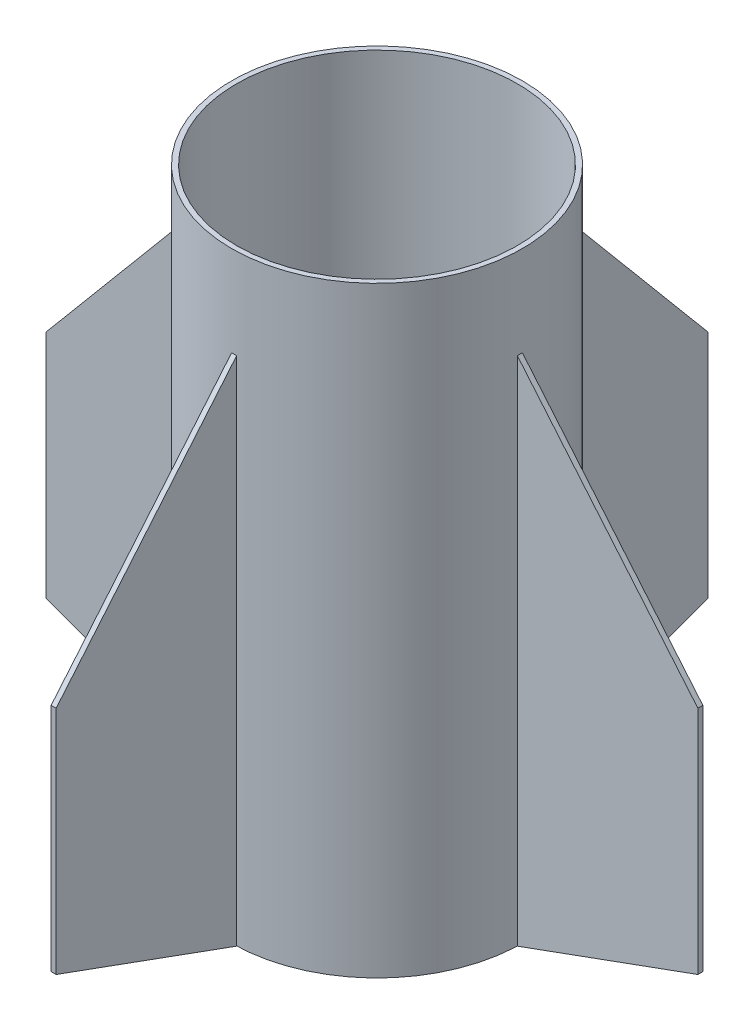
ISO-10303-21;
HEADER;
FILE_DESCRIPTION(('STEP AP214'),'2;1');
FILE_NAME('part.step','',(''),(''),'','','');
FILE_SCHEMA(('AUTOMOTIVE_DESIGN { 1 0 10303 214 1 1 1 1 }'));
ENDSEC;
DATA;
#1=APPLICATION_CONTEXT('core data for automotive mechanical design processes');
#2=APPLICATION_PROTOCOL_DEFINITION('international standard','automotive_design',2000,#1);
#3=PRODUCT_CONTEXT('',#1,'mechanical');
#4=PRODUCT('Part','Part','',(#3));
#5=PRODUCT_RELATED_PRODUCT_CATEGORY('part','',(#4));
#6=PRODUCT_DEFINITION_FORMATION('','',#4);
#7=PRODUCT_DEFINITION_CONTEXT('part definition',#1,'design');
#8=PRODUCT_DEFINITION('design','',#6,#7);
#9=PRODUCT_DEFINITION_SHAPE('','',#8);
#10=(LENGTH_UNIT() NAMED_UNIT(*) SI_UNIT(.MILLI.,.METRE.));
#11=(NAMED_UNIT(*) PLANE_ANGLE_UNIT() SI_UNIT($,.RADIAN.));
#12=(NAMED_UNIT(*) SI_UNIT($,.STERADIAN.) SOLID_ANGLE_UNIT());
#13=UNCERTAINTY_MEASURE_WITH_UNIT(LENGTH_MEASURE(1.E-05),#10,'distance_accuracy_value','');
#14=(GEOMETRIC_REPRESENTATION_CONTEXT(3) GLOBAL_UNCERTAINTY_ASSIGNED_CONTEXT((#13)) GLOBAL_UNIT_ASSIGNED_CONTEXT((#10,
#11,#12)) REPRESENTATION_CONTEXT('',''));
#15=CARTESIAN_POINT('',(0.,0.,0.));
#16=DIRECTION('',(0.,0.,1.));
#17=DIRECTION('',(1.,0.,0.));
#18=AXIS2_PLACEMENT_3D('',#15,#16,#17);
#19=CARTESIAN_POINT('',(92.075,0.,3.175));
#20=DIRECTION('',(1.,0.,0.));
#21=DIRECTION('',(0.,0.,-1.));
#22=AXIS2_PLACEMENT_3D('',#19,#20,#21);
#23=PLANE('',#22);
#24=DIRECTION('',(0.,-1.,0.));
#25=VECTOR('',#24,1.);
#26=CARTESIAN_POINT('',(92.075,0.,0.));
#27=LINE('',#26,#25);
#28=CARTESIAN_POINT('',(92.075,323.85,0.));
#29=VERTEX_POINT('',#28);
#30=CARTESIAN_POINT('',(92.075,0.,0.));
#31=VERTEX_POINT('',#30);
#32=EDGE_CURVE('E110',#29,#31,#27,.T.);
#33=ORIENTED_EDGE('',*,*,#32,.T.);
#34=DIRECTION('',(0.,0.,-1.));
#35=VECTOR('',#34,1.);
#36=CARTESIAN_POINT('',(92.075,0.,3.175));
#37=LINE('',#36,#35);
#38=CARTESIAN_POINT('',(92.075,0.,3.175));
#39=VERTEX_POINT('',#38);
#40=EDGE_CURVE('E12',#39,#31,#37,.T.);
#41=ORIENTED_EDGE('',*,*,#40,.F.);
#42=DIRECTION('',(0.,-1.,0.));
#43=VECTOR('',#42,1.);
#44=CARTESIAN_POINT('',(92.075,0.,3.175));
#45=LINE('',#44,#43);
#46=CARTESIAN_POINT('',(92.075,323.85,3.175));
#47=VERTEX_POINT('',#46);
#48=EDGE_CURVE('E98',#47,#39,#45,.T.);
#49=ORIENTED_EDGE('',*,*,#48,.F.);
#50=DIRECTION('',(0.,0.,-1.));
#51=VECTOR('',#50,1.);
#52=CARTESIAN_POINT('',(92.075,323.85,3.175));
#53=LINE('',#52,#51);
#54=EDGE_CURVE('E106',#47,#29,#53,.T.);
#55=ORIENTED_EDGE('',*,*,#54,.T.);
#56=EDGE_LOOP('',(#33,#41,#49,#55));
#57=FACE_BOUND('',#56,.T.);
#58=ADVANCED_FACE('F47',(#57),#23,.F.);
#59=CARTESIAN_POINT('',(206.375,41.6076727565022,3.175));
#60=DIRECTION('',(-0.342062792128058,0.939677096795254,0.));
#61=DIRECTION('',(-0.939677096795254,-0.342062792128058,0.));
#62=AXIS2_PLACEMENT_3D('',#59,#60,#61);
#63=PLANE('',#62);
#64=DIRECTION('',(0.939677096795254,0.342062792128057,0.));
#65=VECTOR('',#64,1.);
#66=CARTESIAN_POINT('',(206.375,41.6076727565022,0.));
#67=LINE('',#66,#65);
#68=CARTESIAN_POINT('',(206.375,41.6076727565022,0.));
#69=VERTEX_POINT('',#68);
#70=EDGE_CURVE('E102',#31,#69,#67,.T.);
#71=ORIENTED_EDGE('',*,*,#70,.T.);
#72=DIRECTION('',(0.,0.,-1.));
#73=VECTOR('',#72,1.);
#74=CARTESIAN_POINT('',(206.375,41.6076727565022,3.175));
#75=LINE('',#74,#73);
#76=CARTESIAN_POINT('',(206.375,41.6076727565022,3.175));
#77=VERTEX_POINT('',#76);
#78=EDGE_CURVE('E55',#77,#69,#75,.T.);
#79=ORIENTED_EDGE('',*,*,#78,.F.);
#80=DIRECTION('',(0.939677096795254,0.342062792128057,0.));
#81=VECTOR('',#80,1.);
#82=CARTESIAN_POINT('',(206.375,41.6076727565022,3.175));
#83=LINE('',#82,#81);
#84=EDGE_CURVE('E93',#39,#77,#83,.T.);
#85=ORIENTED_EDGE('',*,*,#84,.F.);
#86=ORIENTED_EDGE('',*,*,#40,.T.);
#87=EDGE_LOOP('',(#71,#79,#85,#86));
#88=FACE_BOUND('',#87,.T.);
#89=ADVANCED_FACE('F101',(#88),#63,.F.);
#90=CARTESIAN_POINT('',(206.375,187.657672756502,3.175));
#91=DIRECTION('',(-1.,0.,0.));
#92=DIRECTION('',(0.,0.,1.));
#93=AXIS2_PLACEMENT_3D('',#90,#91,#92);
#94=PLANE('',#93);
#95=DIRECTION('',(0.,1.,0.));
#96=VECTOR('',#95,1.);
#97=CARTESIAN_POINT('',(206.375,187.657672756502,0.));
#98=LINE('',#97,#96);
#99=CARTESIAN_POINT('',(206.375,187.657672756502,0.));
#100=VERTEX_POINT('',#99);
#101=EDGE_CURVE('E80',#69,#100,#98,.T.);
#102=ORIENTED_EDGE('',*,*,#101,.T.);
#103=DIRECTION('',(0.,0.,-1.));
#104=VECTOR('',#103,1.);
#105=CARTESIAN_POINT('',(206.375,187.657672756502,3.175));
#106=LINE('',#105,#104);
#107=CARTESIAN_POINT('',(206.375,187.657672756502,3.175));
#108=VERTEX_POINT('',#107);
#109=EDGE_CURVE('E103',#108,#100,#106,.T.);
#110=ORIENTED_EDGE('',*,*,#109,.F.);
#111=DIRECTION('',(0.,1.,0.));
#112=VECTOR('',#111,1.);
#113=CARTESIAN_POINT('',(206.375,187.657672756502,3.175));
#114=LINE('',#113,#112);
#115=EDGE_CURVE('E96',#77,#108,#114,.T.);
#116=ORIENTED_EDGE('',*,*,#115,.F.);
#117=ORIENTED_EDGE('',*,*,#78,.T.);
#118=EDGE_LOOP('',(#102,#110,#116,#117));
#119=FACE_BOUND('',#118,.T.);
#120=ADVANCED_FACE('F104',(#119),#94,.F.);
#121=CARTESIAN_POINT('',(92.075,323.85,3.175));
#122=DIRECTION('',(-0.765986092483115,-0.642857142857143,0.));
#123=DIRECTION('',(0.642857142857143,-0.765986092483115,0.));
#124=AXIS2_PLACEMENT_3D('',#121,#122,#123);
#125=PLANE('',#124);
#126=DIRECTION('',(-0.642857142857143,0.765986092483115,0.));
#127=VECTOR('',#126,1.);
#128=CARTESIAN_POINT('',(92.075,323.85,0.));
#129=LINE('',#128,#127);
#130=EDGE_CURVE('E86',#100,#29,#129,.T.);
#131=ORIENTED_EDGE('',*,*,#130,.T.);
#132=ORIENTED_EDGE('',*,*,#54,.F.);
#133=DIRECTION('',(-0.642857142857143,0.765986092483115,0.));
#134=VECTOR('',#133,1.);
#135=CARTESIAN_POINT('',(92.075,323.85,3.175));
#136=LINE('',#135,#134);
#137=EDGE_CURVE('E63',#108,#47,#136,.T.);
#138=ORIENTED_EDGE('',*,*,#137,.F.);
#139=ORIENTED_EDGE('',*,*,#109,.T.);
#140=EDGE_LOOP('',(#131,#132,#138,#139));
#141=FACE_BOUND('',#140,.T.);
#142=ADVANCED_FACE('F117',(#141),#125,.F.);
#143=CARTESIAN_POINT('',(0.,0.,3.175));
#144=DIRECTION('',(0.,0.,1.));
#145=DIRECTION('',(1.,0.,0.));
#146=AXIS2_PLACEMENT_3D('',#143,#144,#145);
#147=PLANE('',#146);
#148=ORIENTED_EDGE('',*,*,#48,.T.);
#149=ORIENTED_EDGE('',*,*,#84,.T.);
#150=ORIENTED_EDGE('',*,*,#115,.T.);
#151=ORIENTED_EDGE('',*,*,#137,.T.);
#152=EDGE_LOOP('',(#148,#149,#150,#151));
#153=FACE_BOUND('',#152,.T.);
#154=ADVANCED_FACE('F94',(#153),#147,.T.);
#155=CARTESIAN_POINT('',(0.,0.,0.));
#156=DIRECTION('',(0.,0.,1.));
#157=DIRECTION('',(1.,0.,0.));
#158=AXIS2_PLACEMENT_3D('',#155,#156,#157);
#159=PLANE('',#158);
#160=ORIENTED_EDGE('',*,*,#32,.F.);
#161=ORIENTED_EDGE('',*,*,#130,.F.);
#162=ORIENTED_EDGE('',*,*,#101,.F.);
#163=ORIENTED_EDGE('',*,*,#70,.F.);
#164=EDGE_LOOP('',(#160,#161,#162,#163));
#165=FACE_BOUND('',#164,.T.);
#166=ADVANCED_FACE('F120',(#165),#159,.F.);
#167=CLOSED_SHELL('',(#58,#89,#120,#142,#154,#166));
#168=MANIFOLD_SOLID_BREP('B2',#167);
#169=CARTESIAN_POINT('',(-92.075,323.85,3.175));
#170=DIRECTION('',(-1.,0.,0.));
#171=DIRECTION('',(0.,0.,1.));
#172=AXIS2_PLACEMENT_3D('',#169,#170,#171);
#173=PLANE('',#172);
#174=DIRECTION('',(0.,1.,0.));
#175=VECTOR('',#174,1.);
#176=CARTESIAN_POINT('',(-92.075,323.85,0.));
#177=LINE('',#176,#175);
#178=CARTESIAN_POINT('',(-92.075,0.,0.));
#179=VERTEX_POINT('',#178);
#180=CARTESIAN_POINT('',(-92.075,323.85,0.));
#181=VERTEX_POINT('',#180);
#182=EDGE_CURVE('E243',#179,#181,#177,.T.);
#183=ORIENTED_EDGE('',*,*,#182,.T.);
#184=DIRECTION('',(0.,0.,-1.));
#185=VECTOR('',#184,1.);
#186=CARTESIAN_POINT('',(-92.075,323.85,3.175));
#187=LINE('',#186,#185);
#188=CARTESIAN_POINT('',(-92.075,323.85,3.175));
#189=VERTEX_POINT('',#188);
#190=EDGE_CURVE('E45',#189,#181,#187,.T.);
#191=ORIENTED_EDGE('',*,*,#190,.F.);
#192=DIRECTION('',(0.,1.,0.));
#193=VECTOR('',#192,1.);
#194=CARTESIAN_POINT('',(-92.075,323.85,3.175));
#195=LINE('',#194,#193);
#196=CARTESIAN_POINT('',(-92.075,0.,3.175));
#197=VERTEX_POINT('',#196);
#198=EDGE_CURVE('E231',#197,#189,#195,.T.);
#199=ORIENTED_EDGE('',*,*,#198,.F.);
#200=DIRECTION('',(0.,0.,-1.));
#201=VECTOR('',#200,1.);
#202=CARTESIAN_POINT('',(-92.075,0.,3.175));
#203=LINE('',#202,#201);
#204=EDGE_CURVE('E239',#197,#179,#203,.T.);
#205=ORIENTED_EDGE('',*,*,#204,.T.);
#206=EDGE_LOOP('',(#183,#191,#199,#205));
#207=FACE_BOUND('',#206,.T.);
#208=ADVANCED_FACE('F180',(#207),#173,.F.);
#209=CARTESIAN_POINT('',(-92.075,323.85,3.175));
#210=DIRECTION('',(0.765986092483115,-0.642857142857143,0.));
#211=DIRECTION('',(0.642857142857143,0.765986092483115,0.));
#212=AXIS2_PLACEMENT_3D('',#209,#210,#211);
#213=PLANE('',#212);
#214=DIRECTION('',(-0.642857142857143,-0.765986092483115,0.));
#215=VECTOR('',#214,1.);
#216=CARTESIAN_POINT('',(-92.075,323.85,0.));
#217=LINE('',#216,#215);
#218=CARTESIAN_POINT('',(-206.375,187.657672756502,0.));
#219=VERTEX_POINT('',#218);
#220=EDGE_CURVE('E235',#181,#219,#217,.T.);
#221=ORIENTED_EDGE('',*,*,#220,.T.);
#222=DIRECTION('',(0.,0.,-1.));
#223=VECTOR('',#222,1.);
#224=CARTESIAN_POINT('',(-206.375,187.657672756502,3.175));
#225=LINE('',#224,#223);
#226=CARTESIAN_POINT('',(-206.375,187.657672756502,3.175));
#227=VERTEX_POINT('',#226);
#228=EDGE_CURVE('E188',#227,#219,#225,.T.);
#229=ORIENTED_EDGE('',*,*,#228,.F.);
#230=DIRECTION('',(-0.642857142857143,-0.765986092483115,0.));
#231=VECTOR('',#230,1.);
#232=CARTESIAN_POINT('',(-92.075,323.85,3.175));
#233=LINE('',#232,#231);
#234=EDGE_CURVE('E226',#189,#227,#233,.T.);
#235=ORIENTED_EDGE('',*,*,#234,.F.);
#236=ORIENTED_EDGE('',*,*,#190,.T.);
#237=EDGE_LOOP('',(#221,#229,#235,#236));
#238=FACE_BOUND('',#237,.T.);
#239=ADVANCED_FACE('F234',(#238),#213,.F.);
#240=CARTESIAN_POINT('',(-206.375,187.657672756502,3.175));
#241=DIRECTION('',(1.,0.,0.));
#242=DIRECTION('',(0.,0.,-1.));
#243=AXIS2_PLACEMENT_3D('',#240,#241,#242);
#244=PLANE('',#243);
#245=DIRECTION('',(0.,-1.,0.));
#246=VECTOR('',#245,1.);
#247=CARTESIAN_POINT('',(-206.375,187.657672756502,0.));
#248=LINE('',#247,#246);
#249=CARTESIAN_POINT('',(-206.375,41.6076727565022,0.));
#250=VERTEX_POINT('',#249);
#251=EDGE_CURVE('E213',#219,#250,#248,.T.);
#252=ORIENTED_EDGE('',*,*,#251,.T.);
#253=DIRECTION('',(0.,0.,-1.));
#254=VECTOR('',#253,1.);
#255=CARTESIAN_POINT('',(-206.375,41.6076727565022,3.175));
#256=LINE('',#255,#254);
#257=CARTESIAN_POINT('',(-206.375,41.6076727565022,3.175));
#258=VERTEX_POINT('',#257);
#259=EDGE_CURVE('E236',#258,#250,#256,.T.);
#260=ORIENTED_EDGE('',*,*,#259,.F.);
#261=DIRECTION('',(0.,-1.,0.));
#262=VECTOR('',#261,1.);
#263=CARTESIAN_POINT('',(-206.375,187.657672756502,3.175));
#264=LINE('',#263,#262);
#265=EDGE_CURVE('E229',#227,#258,#264,.T.);
#266=ORIENTED_EDGE('',*,*,#265,.F.);
#267=ORIENTED_EDGE('',*,*,#228,.T.);
#268=EDGE_LOOP('',(#252,#260,#266,#267));
#269=FACE_BOUND('',#268,.T.);
#270=ADVANCED_FACE('F237',(#269),#244,.F.);
#271=CARTESIAN_POINT('',(-206.375,41.6076727565022,3.175));
#272=DIRECTION('',(0.342062792128057,0.939677096795254,0.));
#273=DIRECTION('',(-0.939677096795254,0.342062792128057,0.));
#274=AXIS2_PLACEMENT_3D('',#271,#272,#273);
#275=PLANE('',#274);
#276=DIRECTION('',(0.939677096795254,-0.342062792128057,0.));
#277=VECTOR('',#276,1.);
#278=CARTESIAN_POINT('',(-206.375,41.6076727565022,0.));
#279=LINE('',#278,#277);
#280=EDGE_CURVE('E219',#250,#179,#279,.T.);
#281=ORIENTED_EDGE('',*,*,#280,.T.);
#282=ORIENTED_EDGE('',*,*,#204,.F.);
#283=DIRECTION('',(0.939677096795254,-0.342062792128057,0.));
#284=VECTOR('',#283,1.);
#285=CARTESIAN_POINT('',(-206.375,41.6076727565022,3.175));
#286=LINE('',#285,#284);
#287=EDGE_CURVE('E196',#258,#197,#286,.T.);
#288=ORIENTED_EDGE('',*,*,#287,.F.);
#289=ORIENTED_EDGE('',*,*,#259,.T.);
#290=EDGE_LOOP('',(#281,#282,#288,#289));
#291=FACE_BOUND('',#290,.T.);
#292=ADVANCED_FACE('F250',(#291),#275,.F.);
#293=CARTESIAN_POINT('',(0.,0.,3.175));
#294=DIRECTION('',(0.,0.,1.));
#295=DIRECTION('',(1.,0.,0.));
#296=AXIS2_PLACEMENT_3D('',#293,#294,#295);
#297=PLANE('',#296);
#298=ORIENTED_EDGE('',*,*,#198,.T.);
#299=ORIENTED_EDGE('',*,*,#234,.T.);
#300=ORIENTED_EDGE('',*,*,#265,.T.);
#301=ORIENTED_EDGE('',*,*,#287,.T.);
#302=EDGE_LOOP('',(#298,#299,#300,#301));
#303=FACE_BOUND('',#302,.T.);
#304=ADVANCED_FACE('F227',(#303),#297,.T.);
#305=CARTESIAN_POINT('',(0.,0.,0.));
#306=DIRECTION('',(0.,0.,1.));
#307=DIRECTION('',(1.,0.,0.));
#308=AXIS2_PLACEMENT_3D('',#305,#306,#307);
#309=PLANE('',#308);
#310=ORIENTED_EDGE('',*,*,#182,.F.);
#311=ORIENTED_EDGE('',*,*,#280,.F.);
#312=ORIENTED_EDGE('',*,*,#251,.F.);
#313=ORIENTED_EDGE('',*,*,#220,.F.);
#314=EDGE_LOOP('',(#310,#311,#312,#313));
#315=FACE_BOUND('',#314,.T.);
#316=ADVANCED_FACE('F253',(#315),#309,.F.);
#317=CLOSED_SHELL('',(#208,#239,#270,#292,#304,#316));
#318=MANIFOLD_SOLID_BREP('B6',#317);
#319=CARTESIAN_POINT('',(3.175,323.85,-92.075));
#320=DIRECTION('',(0.,0.,-1.));
#321=DIRECTION('',(0.,1.,0.));
#322=AXIS2_PLACEMENT_3D('',#319,#320,#321);
#323=PLANE('',#322);
#324=DIRECTION('',(0.,-1.,0.));
#325=VECTOR('',#324,1.);
#326=CARTESIAN_POINT('',(0.,323.85,-92.075));
#327=LINE('',#326,#325);
#328=CARTESIAN_POINT('',(0.,323.85,-92.075));
#329=VERTEX_POINT('',#328);
#330=CARTESIAN_POINT('',(0.,0.,-92.075));
#331=VERTEX_POINT('',#330);
#332=EDGE_CURVE('E376',#329,#331,#327,.T.);
#333=ORIENTED_EDGE('',*,*,#332,.T.);
#334=DIRECTION('',(-1.,0.,0.));
#335=VECTOR('',#334,1.);
#336=CARTESIAN_POINT('',(3.175,0.,-92.075));
#337=LINE('',#336,#335);
#338=CARTESIAN_POINT('',(3.175,0.,-92.075));
#339=VERTEX_POINT('',#338);
#340=EDGE_CURVE('E178',#339,#331,#337,.T.);
#341=ORIENTED_EDGE('',*,*,#340,.F.);
#342=DIRECTION('',(0.,-1.,0.));
#343=VECTOR('',#342,1.);
#344=CARTESIAN_POINT('',(3.175,323.85,-92.075));
#345=LINE('',#344,#343);
#346=CARTESIAN_POINT('',(3.175,323.85,-92.075));
#347=VERTEX_POINT('',#346);
#348=EDGE_CURVE('E364',#347,#339,#345,.T.);
#349=ORIENTED_EDGE('',*,*,#348,.F.);
#350=DIRECTION('',(-1.,0.,0.));
#351=VECTOR('',#350,1.);
#352=CARTESIAN_POINT('',(3.175,323.85,-92.075));
#353=LINE('',#352,#351);
#354=EDGE_CURVE('E372',#347,#329,#353,.T.);
#355=ORIENTED_EDGE('',*,*,#354,.T.);
#356=EDGE_LOOP('',(#333,#341,#349,#355));
#357=FACE_BOUND('',#356,.T.);
#358=ADVANCED_FACE('F313',(#357),#323,.F.);
#359=CARTESIAN_POINT('',(3.175,41.6076727565022,-206.375));
#360=DIRECTION('',(0.,0.939677096795254,0.342062792128058));
#361=DIRECTION('',(0.,-0.342062792128058,0.939677096795254));
#362=AXIS2_PLACEMENT_3D('',#359,#360,#361);
#363=PLANE('',#362);
#364=DIRECTION('',(0.,0.342062792128058,-0.939677096795254));
#365=VECTOR('',#364,1.);
#366=CARTESIAN_POINT('',(0.,41.6076727565022,-206.375));
#367=LINE('',#366,#365);
#368=CARTESIAN_POINT('',(0.,41.6076727565022,-206.375));
#369=VERTEX_POINT('',#368);
#370=EDGE_CURVE('E368',#331,#369,#367,.T.);
#371=ORIENTED_EDGE('',*,*,#370,.T.);
#372=DIRECTION('',(-1.,0.,0.));
#373=VECTOR('',#372,1.);
#374=CARTESIAN_POINT('',(3.175,41.6076727565022,-206.375));
#375=LINE('',#374,#373);
#376=CARTESIAN_POINT('',(3.175,41.6076727565022,-206.375));
#377=VERTEX_POINT('',#376);
#378=EDGE_CURVE('E321',#377,#369,#375,.T.);
#379=ORIENTED_EDGE('',*,*,#378,.F.);
#380=DIRECTION('',(0.,0.342062792128058,-0.939677096795254));
#381=VECTOR('',#380,1.);
#382=CARTESIAN_POINT('',(3.175,41.6076727565022,-206.375));
#383=LINE('',#382,#381);
#384=EDGE_CURVE('E359',#339,#377,#383,.T.);
#385=ORIENTED_EDGE('',*,*,#384,.F.);
#386=ORIENTED_EDGE('',*,*,#340,.T.);
#387=EDGE_LOOP('',(#371,#379,#385,#386));
#388=FACE_BOUND('',#387,.T.);
#389=ADVANCED_FACE('F367',(#388),#363,.F.);
#390=CARTESIAN_POINT('',(3.175,187.657672756502,-206.375));
#391=DIRECTION('',(0.,0.,1.));
#392=DIRECTION('',(0.,-1.,0.));
#393=AXIS2_PLACEMENT_3D('',#390,#391,#392);
#394=PLANE('',#393);
#395=DIRECTION('',(0.,1.,0.));
#396=VECTOR('',#395,1.);
#397=CARTESIAN_POINT('',(0.,187.657672756502,-206.375));
#398=LINE('',#397,#396);
#399=CARTESIAN_POINT('',(0.,187.657672756502,-206.375));
#400=VERTEX_POINT('',#399);
#401=EDGE_CURVE('E346',#369,#400,#398,.T.);
#402=ORIENTED_EDGE('',*,*,#401,.T.);
#403=DIRECTION('',(-1.,0.,0.));
#404=VECTOR('',#403,1.);
#405=CARTESIAN_POINT('',(3.175,187.657672756502,-206.375));
#406=LINE('',#405,#404);
#407=CARTESIAN_POINT('',(3.175,187.657672756502,-206.375));
#408=VERTEX_POINT('',#407);
#409=EDGE_CURVE('E369',#408,#400,#406,.T.);
#410=ORIENTED_EDGE('',*,*,#409,.F.);
#411=DIRECTION('',(0.,1.,0.));
#412=VECTOR('',#411,1.);
#413=CARTESIAN_POINT('',(3.175,187.657672756502,-206.375));
#414=LINE('',#413,#412);
#415=EDGE_CURVE('E362',#377,#408,#414,.T.);
#416=ORIENTED_EDGE('',*,*,#415,.F.);
#417=ORIENTED_EDGE('',*,*,#378,.T.);
#418=EDGE_LOOP('',(#402,#410,#416,#417));
#419=FACE_BOUND('',#418,.T.);
#420=ADVANCED_FACE('F370',(#419),#394,.F.);
#421=CARTESIAN_POINT('',(3.175,323.85,-92.075));
#422=DIRECTION('',(0.,-0.642857142857143,0.765986092483115));
#423=DIRECTION('',(0.,-0.765986092483115,-0.642857142857143));
#424=AXIS2_PLACEMENT_3D('',#421,#422,#423);
#425=PLANE('',#424);
#426=DIRECTION('',(0.,0.765986092483115,0.642857142857143));
#427=VECTOR('',#426,1.);
#428=CARTESIAN_POINT('',(0.,323.85,-92.075));
#429=LINE('',#428,#427);
#430=EDGE_CURVE('E352',#400,#329,#429,.T.);
#431=ORIENTED_EDGE('',*,*,#430,.T.);
#432=ORIENTED_EDGE('',*,*,#354,.F.);
#433=DIRECTION('',(0.,0.765986092483115,0.642857142857143));
#434=VECTOR('',#433,1.);
#435=CARTESIAN_POINT('',(3.175,323.85,-92.075));
#436=LINE('',#435,#434);
#437=EDGE_CURVE('E329',#408,#347,#436,.T.);
#438=ORIENTED_EDGE('',*,*,#437,.F.);
#439=ORIENTED_EDGE('',*,*,#409,.T.);
#440=EDGE_LOOP('',(#431,#432,#438,#439));
#441=FACE_BOUND('',#440,.T.);
#442=ADVANCED_FACE('F383',(#441),#425,.F.);
#443=CARTESIAN_POINT('',(3.175,0.,0.));
#444=DIRECTION('',(-1.,0.,0.));
#445=DIRECTION('',(0.,0.,1.));
#446=AXIS2_PLACEMENT_3D('',#443,#444,#445);
#447=PLANE('',#446);
#448=ORIENTED_EDGE('',*,*,#348,.T.);
#449=ORIENTED_EDGE('',*,*,#384,.T.);
#450=ORIENTED_EDGE('',*,*,#415,.T.);
#451=ORIENTED_EDGE('',*,*,#437,.T.);
#452=EDGE_LOOP('',(#448,#449,#450,#451));
#453=FACE_BOUND('',#452,.T.);
#454=ADVANCED_FACE('F360',(#453),#447,.F.);
#455=CARTESIAN_POINT('',(0.,0.,0.));
#456=DIRECTION('',(-1.,0.,0.));
#457=DIRECTION('',(0.,0.,1.));
#458=AXIS2_PLACEMENT_3D('',#455,#456,#457);
#459=PLANE('',#458);
#460=ORIENTED_EDGE('',*,*,#332,.F.);
#461=ORIENTED_EDGE('',*,*,#430,.F.);
#462=ORIENTED_EDGE('',*,*,#401,.F.);
#463=ORIENTED_EDGE('',*,*,#370,.F.);
#464=EDGE_LOOP('',(#460,#461,#462,#463));
#465=FACE_BOUND('',#464,.T.);
#466=ADVANCED_FACE('F386',(#465),#459,.T.);
#467=CLOSED_SHELL('',(#358,#389,#420,#442,#454,#466));
#468=MANIFOLD_SOLID_BREP('B39',#467);
#469=CARTESIAN_POINT('',(3.175,0.,92.075));
#470=DIRECTION('',(0.,0.,1.));
#471=DIRECTION('',(1.,0.,0.));
#472=AXIS2_PLACEMENT_3D('',#469,#470,#471);
#473=PLANE('',#472);
#474=DIRECTION('',(0.,1.,0.));
#475=VECTOR('',#474,1.);
#476=CARTESIAN_POINT('',(0.,0.,92.075));
#477=LINE('',#476,#475);
#478=CARTESIAN_POINT('',(0.,0.,92.075));
#479=VERTEX_POINT('',#478);
#480=CARTESIAN_POINT('',(0.,323.85,92.075));
#481=VERTEX_POINT('',#480);
#482=EDGE_CURVE('E506',#479,#481,#477,.T.);
#483=ORIENTED_EDGE('',*,*,#482,.T.);
#484=DIRECTION('',(-1.,0.,0.));
#485=VECTOR('',#484,1.);
#486=CARTESIAN_POINT('',(3.175,323.85,92.075));
#487=LINE('',#486,#485);
#488=CARTESIAN_POINT('',(3.175,323.85,92.075));
#489=VERTEX_POINT('',#488);
#490=EDGE_CURVE('E311',#489,#481,#487,.T.);
#491=ORIENTED_EDGE('',*,*,#490,.F.);
#492=DIRECTION('',(0.,1.,0.));
#493=VECTOR('',#492,1.);
#494=CARTESIAN_POINT('',(3.175,0.,92.075));
#495=LINE('',#494,#493);
#496=CARTESIAN_POINT('',(3.175,0.,92.075));
#497=VERTEX_POINT('',#496);
#498=EDGE_CURVE('E494',#497,#489,#495,.T.);
#499=ORIENTED_EDGE('',*,*,#498,.F.);
#500=DIRECTION('',(-1.,0.,0.));
#501=VECTOR('',#500,1.);
#502=CARTESIAN_POINT('',(3.175,0.,92.075));
#503=LINE('',#502,#501);
#504=EDGE_CURVE('E502',#497,#479,#503,.T.);
#505=ORIENTED_EDGE('',*,*,#504,.T.);
#506=EDGE_LOOP('',(#483,#491,#499,#505));
#507=FACE_BOUND('',#506,.T.);
#508=ADVANCED_FACE('F443',(#507),#473,.F.);
#509=CARTESIAN_POINT('',(3.175,323.85,92.075));
#510=DIRECTION('',(0.,-0.642857142857143,-0.765986092483115));
#511=DIRECTION('',(0.,0.765986092483115,-0.642857142857143));
#512=AXIS2_PLACEMENT_3D('',#509,#510,#511);
#513=PLANE('',#512);
#514=DIRECTION('',(0.,-0.765986092483115,0.642857142857143));
#515=VECTOR('',#514,1.);
#516=CARTESIAN_POINT('',(0.,323.85,92.075));
#517=LINE('',#516,#515);
#518=CARTESIAN_POINT('',(0.,187.657672756502,206.375));
#519=VERTEX_POINT('',#518);
#520=EDGE_CURVE('E498',#481,#519,#517,.T.);
#521=ORIENTED_EDGE('',*,*,#520,.T.);
#522=DIRECTION('',(-1.,0.,0.));
#523=VECTOR('',#522,1.);
#524=CARTESIAN_POINT('',(3.175,187.657672756502,206.375));
#525=LINE('',#524,#523);
#526=CARTESIAN_POINT('',(3.175,187.657672756502,206.375));
#527=VERTEX_POINT('',#526);
#528=EDGE_CURVE('E451',#527,#519,#525,.T.);
#529=ORIENTED_EDGE('',*,*,#528,.F.);
#530=DIRECTION('',(0.,-0.765986092483115,0.642857142857143));
#531=VECTOR('',#530,1.);
#532=CARTESIAN_POINT('',(3.175,323.85,92.075));
#533=LINE('',#532,#531);
#534=EDGE_CURVE('E489',#489,#527,#533,.T.);
#535=ORIENTED_EDGE('',*,*,#534,.F.);
#536=ORIENTED_EDGE('',*,*,#490,.T.);
#537=EDGE_LOOP('',(#521,#529,#535,#536));
#538=FACE_BOUND('',#537,.T.);
#539=ADVANCED_FACE('F497',(#538),#513,.F.);
#540=CARTESIAN_POINT('',(3.175,187.657672756502,206.375));
#541=DIRECTION('',(0.,0.,-1.));
#542=DIRECTION('',(0.,1.,0.));
#543=AXIS2_PLACEMENT_3D('',#540,#541,#542);
#544=PLANE('',#543);
#545=DIRECTION('',(0.,-1.,0.));
#546=VECTOR('',#545,1.);
#547=CARTESIAN_POINT('',(0.,187.657672756502,206.375));
#548=LINE('',#547,#546);
#549=CARTESIAN_POINT('',(0.,41.6076727565022,206.375));
#550=VERTEX_POINT('',#549);
#551=EDGE_CURVE('E476',#519,#550,#548,.T.);
#552=ORIENTED_EDGE('',*,*,#551,.T.);
#553=DIRECTION('',(-1.,0.,0.));
#554=VECTOR('',#553,1.);
#555=CARTESIAN_POINT('',(3.175,41.6076727565022,206.375));
#556=LINE('',#555,#554);
#557=CARTESIAN_POINT('',(3.175,41.6076727565022,206.375));
#558=VERTEX_POINT('',#557);
#559=EDGE_CURVE('E499',#558,#550,#556,.T.);
#560=ORIENTED_EDGE('',*,*,#559,.F.);
#561=DIRECTION('',(0.,-1.,0.));
#562=VECTOR('',#561,1.);
#563=CARTESIAN_POINT('',(3.175,187.657672756502,206.375));
#564=LINE('',#563,#562);
#565=EDGE_CURVE('E492',#527,#558,#564,.T.);
#566=ORIENTED_EDGE('',*,*,#565,.F.);
#567=ORIENTED_EDGE('',*,*,#528,.T.);
#568=EDGE_LOOP('',(#552,#560,#566,#567));
#569=FACE_BOUND('',#568,.T.);
#570=ADVANCED_FACE('F500',(#569),#544,.F.);
#571=CARTESIAN_POINT('',(3.175,41.6076727565022,206.375));
#572=DIRECTION('',(0.,0.939677096795254,-0.342062792128057));
#573=DIRECTION('',(0.,0.342062792128057,0.939677096795254));
#574=AXIS2_PLACEMENT_3D('',#571,#572,#573);
#575=PLANE('',#574);
#576=DIRECTION('',(0.,-0.342062792128057,-0.939677096795254));
#577=VECTOR('',#576,1.);
#578=CARTESIAN_POINT('',(0.,41.6076727565022,206.375));
#579=LINE('',#578,#577);
#580=EDGE_CURVE('E482',#550,#479,#579,.T.);
#581=ORIENTED_EDGE('',*,*,#580,.T.);
#582=ORIENTED_EDGE('',*,*,#504,.F.);
#583=DIRECTION('',(0.,-0.342062792128057,-0.939677096795254));
#584=VECTOR('',#583,1.);
#585=CARTESIAN_POINT('',(3.175,41.6076727565022,206.375));
#586=LINE('',#585,#584);
#587=EDGE_CURVE('E459',#558,#497,#586,.T.);
#588=ORIENTED_EDGE('',*,*,#587,.F.);
#589=ORIENTED_EDGE('',*,*,#559,.T.);
#590=EDGE_LOOP('',(#581,#582,#588,#589));
#591=FACE_BOUND('',#590,.T.);
#592=ADVANCED_FACE('F513',(#591),#575,.F.);
#593=CARTESIAN_POINT('',(3.175,0.,0.));
#594=DIRECTION('',(-1.,0.,0.));
#595=DIRECTION('',(0.,0.,1.));
#596=AXIS2_PLACEMENT_3D('',#593,#594,#595);
#597=PLANE('',#596);
#598=ORIENTED_EDGE('',*,*,#498,.T.);
#599=ORIENTED_EDGE('',*,*,#534,.T.);
#600=ORIENTED_EDGE('',*,*,#565,.T.);
#601=ORIENTED_EDGE('',*,*,#587,.T.);
#602=EDGE_LOOP('',(#598,#599,#600,#601));
#603=FACE_BOUND('',#602,.T.);
#604=ADVANCED_FACE('F490',(#603),#597,.F.);
#605=CARTESIAN_POINT('',(0.,0.,0.));
#606=DIRECTION('',(-1.,0.,0.));
#607=DIRECTION('',(0.,0.,1.));
#608=AXIS2_PLACEMENT_3D('',#605,#606,#607);
#609=PLANE('',#608);
#610=ORIENTED_EDGE('',*,*,#482,.F.);
#611=ORIENTED_EDGE('',*,*,#580,.F.);
#612=ORIENTED_EDGE('',*,*,#551,.F.);
#613=ORIENTED_EDGE('',*,*,#520,.F.);
#614=EDGE_LOOP('',(#610,#611,#612,#613));
#615=FACE_BOUND('',#614,.T.);
#616=ADVANCED_FACE('F516',(#615),#609,.T.);
#617=CLOSED_SHELL('',(#508,#539,#570,#592,#604,#616));
#618=MANIFOLD_SOLID_BREP('B172',#617);
#619=CARTESIAN_POINT('',(0.,381.,0.));
#620=DIRECTION('',(0.,1.,0.));
#621=DIRECTION('',(0.,0.,1.));
#622=AXIS2_PLACEMENT_3D('',#619,#620,#621);
#623=PLANE('',#622);
#624=CARTESIAN_POINT('',(0.,381.,0.));
#625=DIRECTION('',(0.,1.,0.));
#626=DIRECTION('',(0.,0.,1.));
#627=AXIS2_PLACEMENT_3D('',#624,#625,#626);
#628=CIRCLE('',#627,92.075);
#629=CARTESIAN_POINT('',(0.,381.,92.075));
#630=VERTEX_POINT('',#629);
#631=EDGE_CURVE('E442',#630,#630,#628,.T.);
#632=ORIENTED_EDGE('',*,*,#631,.T.);
#633=EDGE_LOOP('',(#632));
#634=FACE_BOUND('',#633,.T.);
#635=CARTESIAN_POINT('',(0.,381.,0.));
#636=DIRECTION('',(0.,1.,0.));
#637=DIRECTION('',(0.,0.,1.));
#638=AXIS2_PLACEMENT_3D('',#635,#636,#637);
#639=CIRCLE('',#638,88.9);
#640=CARTESIAN_POINT('',(0.,381.,88.9));
#641=VERTEX_POINT('',#640);
#642=EDGE_CURVE('E577',#641,#641,#639,.T.);
#643=ORIENTED_EDGE('',*,*,#642,.F.);
#644=EDGE_LOOP('',(#643));
#645=FACE_BOUND('',#644,.T.);
#646=ADVANCED_FACE('F566',(#634,#645),#623,.T.);
#647=CARTESIAN_POINT('',(0.,0.,0.));
#648=DIRECTION('',(0.,1.,0.));
#649=DIRECTION('',(0.,0.,1.));
#650=AXIS2_PLACEMENT_3D('',#647,#648,#649);
#651=PLANE('',#650);
#652=CARTESIAN_POINT('',(0.,0.,0.));
#653=DIRECTION('',(0.,1.,0.));
#654=DIRECTION('',(0.,0.,1.));
#655=AXIS2_PLACEMENT_3D('',#652,#653,#654);
#656=CIRCLE('',#655,92.075);
#657=CARTESIAN_POINT('',(0.,0.,92.075));
#658=VERTEX_POINT('',#657);
#659=EDGE_CURVE('E570',#658,#658,#656,.T.);
#660=ORIENTED_EDGE('',*,*,#659,.F.);
#661=EDGE_LOOP('',(#660));
#662=FACE_BOUND('',#661,.T.);
#663=CARTESIAN_POINT('',(0.,0.,0.));
#664=DIRECTION('',(0.,1.,0.));
#665=DIRECTION('',(0.,0.,1.));
#666=AXIS2_PLACEMENT_3D('',#663,#664,#665);
#667=CIRCLE('',#666,88.9);
#668=CARTESIAN_POINT('',(0.,0.,88.9));
#669=VERTEX_POINT('',#668);
#670=EDGE_CURVE('E579',#669,#669,#667,.T.);
#671=ORIENTED_EDGE('',*,*,#670,.T.);
#672=EDGE_LOOP('',(#671));
#673=FACE_BOUND('',#672,.T.);
#674=ADVANCED_FACE('F589',(#662,#673),#651,.F.);
#675=CARTESIAN_POINT('',(0.,381.,0.));
#676=DIRECTION('',(0.,-1.,0.));
#677=DIRECTION('',(0.,0.,-1.));
#678=AXIS2_PLACEMENT_3D('',#675,#676,#677);
#679=CYLINDRICAL_SURFACE('',#678,92.075);
#680=ORIENTED_EDGE('',*,*,#631,.F.);
#681=EDGE_LOOP('',(#680));
#682=FACE_BOUND('',#681,.T.);
#683=ORIENTED_EDGE('',*,*,#659,.T.);
#684=EDGE_LOOP('',(#683));
#685=FACE_BOUND('',#684,.T.);
#686=ADVANCED_FACE('F568',(#682,#685),#679,.T.);
#687=CARTESIAN_POINT('',(0.,381.,0.));
#688=DIRECTION('',(0.,-1.,0.));
#689=DIRECTION('',(0.,0.,-1.));
#690=AXIS2_PLACEMENT_3D('',#687,#688,#689);
#691=CYLINDRICAL_SURFACE('',#690,88.9);
#692=ORIENTED_EDGE('',*,*,#642,.T.);
#693=EDGE_LOOP('',(#692));
#694=FACE_BOUND('',#693,.T.);
#695=ORIENTED_EDGE('',*,*,#670,.F.);
#696=EDGE_LOOP('',(#695));
#697=FACE_BOUND('',#696,.T.);
#698=ADVANCED_FACE('F585',(#694,#697),#691,.F.);
#699=CLOSED_SHELL('',(#646,#674,#686,#698));
#700=MANIFOLD_SOLID_BREP('B305',#699);
#701=ADVANCED_BREP_SHAPE_REPRESENTATION('',(#18,#168,#318,#468,#618,#700),#14);
#702=SHAPE_DEFINITION_REPRESENTATION(#9,#701);
ENDSEC;
END-ISO-10303-21;
